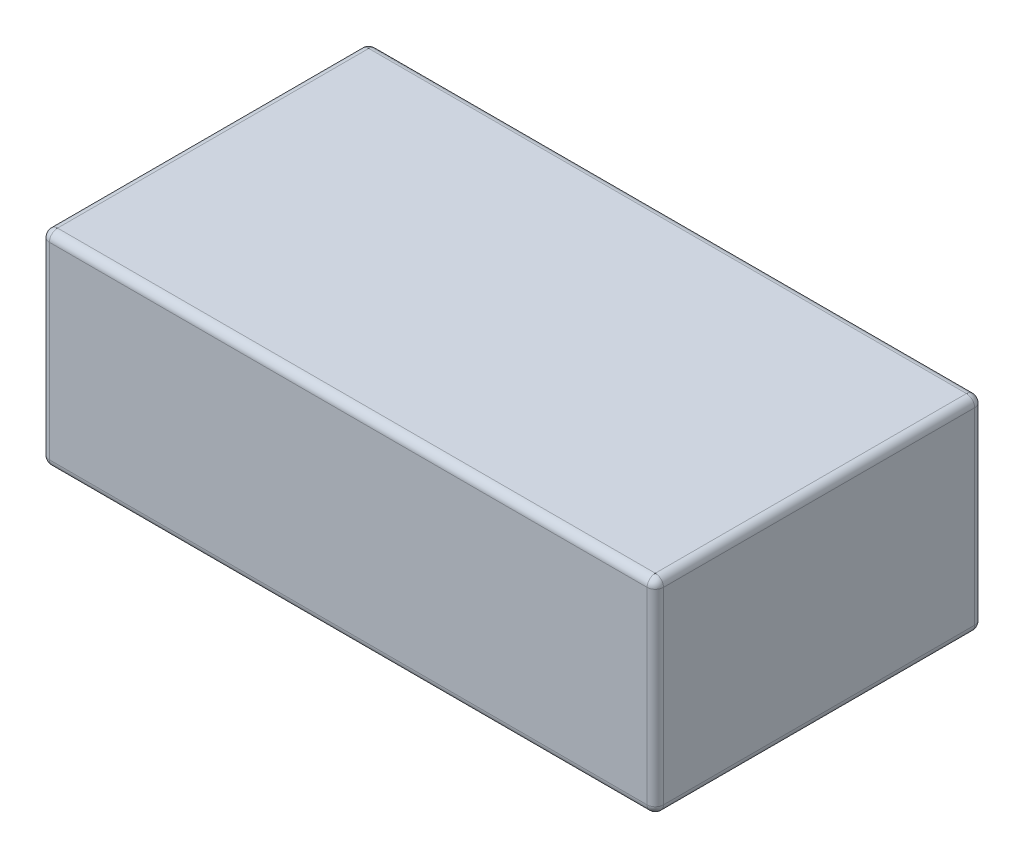
ISO-10303-21;
HEADER;
FILE_DESCRIPTION(('STEP AP214'),'2;1');
FILE_NAME('part.step','',(''),(''),'','','');
FILE_SCHEMA(('AUTOMOTIVE_DESIGN { 1 0 10303 214 1 1 1 1 }'));
ENDSEC;
DATA;
#1=APPLICATION_CONTEXT('core data for automotive mechanical design processes');
#2=APPLICATION_PROTOCOL_DEFINITION('international standard','automotive_design',2000,#1);
#3=PRODUCT_CONTEXT('',#1,'mechanical');
#4=PRODUCT('Part','Part','',(#3));
#5=PRODUCT_RELATED_PRODUCT_CATEGORY('part','',(#4));
#6=PRODUCT_DEFINITION_FORMATION('','',#4);
#7=PRODUCT_DEFINITION_CONTEXT('part definition',#1,'design');
#8=PRODUCT_DEFINITION('design','',#6,#7);
#9=PRODUCT_DEFINITION_SHAPE('','',#8);
#10=(LENGTH_UNIT() NAMED_UNIT(*) SI_UNIT(.MILLI.,.METRE.));
#11=(NAMED_UNIT(*) PLANE_ANGLE_UNIT() SI_UNIT($,.RADIAN.));
#12=(NAMED_UNIT(*) SI_UNIT($,.STERADIAN.) SOLID_ANGLE_UNIT());
#13=UNCERTAINTY_MEASURE_WITH_UNIT(LENGTH_MEASURE(1.E-05),#10,'distance_accuracy_value','');
#14=(GEOMETRIC_REPRESENTATION_CONTEXT(3) GLOBAL_UNCERTAINTY_ASSIGNED_CONTEXT((#13)) GLOBAL_UNIT_ASSIGNED_CONTEXT((#10,
#11,#12)) REPRESENTATION_CONTEXT('',''));
#15=CARTESIAN_POINT('',(0.,0.,0.));
#16=DIRECTION('',(0.,0.,1.));
#17=DIRECTION('',(1.,0.,0.));
#18=AXIS2_PLACEMENT_3D('',#15,#16,#17);
#19=CARTESIAN_POINT('',(-0.73,0.25,0.38));
#20=DIRECTION('',(0.,-1.,0.));
#21=DIRECTION('',(0.,0.,-1.));
#22=AXIS2_PLACEMENT_3D('',#19,#20,#21);
#23=CYLINDRICAL_SURFACE('',#22,0.02);
#24=DIRECTION('',(0.,-1.,0.));
#25=VECTOR('',#24,1.);
#26=CARTESIAN_POINT('',(-0.73,0.25,0.4));
#27=LINE('',#26,#25);
#28=CARTESIAN_POINT('',(-0.73,0.23,0.4));
#29=VERTEX_POINT('',#28);
#30=CARTESIAN_POINT('',(-0.73,-0.23,0.4));
#31=VERTEX_POINT('',#30);
#32=EDGE_CURVE('E152',#29,#31,#27,.T.);
#33=ORIENTED_EDGE('',*,*,#32,.F.);
#34=CARTESIAN_POINT('',(-0.73,0.23,0.38));
#35=DIRECTION('',(0.,-1.,0.));
#36=DIRECTION('',(0.,0.,-1.));
#37=AXIS2_PLACEMENT_3D('',#34,#35,#36);
#38=CIRCLE('',#37,0.02);
#39=CARTESIAN_POINT('',(-0.75,0.23,0.38));
#40=VERTEX_POINT('',#39);
#41=EDGE_CURVE('E139',#29,#40,#38,.T.);
#42=ORIENTED_EDGE('',*,*,#41,.T.);
#43=DIRECTION('',(0.,-1.,0.));
#44=VECTOR('',#43,1.);
#45=CARTESIAN_POINT('',(-0.75,0.25,0.38));
#46=LINE('',#45,#44);
#47=CARTESIAN_POINT('',(-0.75,-0.23,0.38));
#48=VERTEX_POINT('',#47);
#49=EDGE_CURVE('E210',#40,#48,#46,.T.);
#50=ORIENTED_EDGE('',*,*,#49,.T.);
#51=CARTESIAN_POINT('',(-0.73,-0.23,0.38));
#52=DIRECTION('',(0.,-1.,0.));
#53=DIRECTION('',(0.,0.,-1.));
#54=AXIS2_PLACEMENT_3D('',#51,#52,#53);
#55=CIRCLE('',#54,0.02);
#56=EDGE_CURVE('E190',#48,#31,#55,.F.);
#57=ORIENTED_EDGE('',*,*,#56,.T.);
#58=EDGE_LOOP('',(#33,#42,#50,#57));
#59=FACE_BOUND('',#58,.T.);
#60=ADVANCED_FACE('F34',(#59),#23,.T.);
#61=CARTESIAN_POINT('',(-0.73,0.25,0.4));
#62=DIRECTION('',(0.,0.,-1.));
#63=DIRECTION('',(-1.,0.,0.));
#64=AXIS2_PLACEMENT_3D('',#61,#62,#63);
#65=PLANE('',#64);
#66=DIRECTION('',(0.,-1.,0.));
#67=VECTOR('',#66,1.);
#68=CARTESIAN_POINT('',(0.73,0.25,0.4));
#69=LINE('',#68,#67);
#70=CARTESIAN_POINT('',(0.73,0.23,0.4));
#71=VERTEX_POINT('',#70);
#72=CARTESIAN_POINT('',(0.73,-0.23,0.4));
#73=VERTEX_POINT('',#72);
#74=EDGE_CURVE('E270',#71,#73,#69,.T.);
#75=ORIENTED_EDGE('',*,*,#74,.F.);
#76=DIRECTION('',(1.,0.,0.));
#77=VECTOR('',#76,1.);
#78=CARTESIAN_POINT('',(-0.73,0.23,0.4));
#79=LINE('',#78,#77);
#80=EDGE_CURVE('E188',#71,#29,#79,.F.);
#81=ORIENTED_EDGE('',*,*,#80,.T.);
#82=ORIENTED_EDGE('',*,*,#32,.T.);
#83=DIRECTION('',(1.,0.,0.));
#84=VECTOR('',#83,1.);
#85=CARTESIAN_POINT('',(-0.73,-0.23,0.4));
#86=LINE('',#85,#84);
#87=EDGE_CURVE('E185',#31,#73,#86,.T.);
#88=ORIENTED_EDGE('',*,*,#87,.T.);
#89=EDGE_LOOP('',(#75,#81,#82,#88));
#90=FACE_BOUND('',#89,.T.);
#91=ADVANCED_FACE('F312',(#90),#65,.F.);
#92=CARTESIAN_POINT('',(0.73,0.25,0.38));
#93=DIRECTION('',(0.,-1.,0.));
#94=DIRECTION('',(0.,0.,-1.));
#95=AXIS2_PLACEMENT_3D('',#92,#93,#94);
#96=CYLINDRICAL_SURFACE('',#95,0.0200000000000001);
#97=DIRECTION('',(0.,-1.,0.));
#98=VECTOR('',#97,1.);
#99=CARTESIAN_POINT('',(0.75,0.25,0.38));
#100=LINE('',#99,#98);
#101=CARTESIAN_POINT('',(0.75,0.23,0.38));
#102=VERTEX_POINT('',#101);
#103=CARTESIAN_POINT('',(0.75,-0.23,0.38));
#104=VERTEX_POINT('',#103);
#105=EDGE_CURVE('E267',#102,#104,#100,.T.);
#106=ORIENTED_EDGE('',*,*,#105,.F.);
#107=CARTESIAN_POINT('',(0.73,0.23,0.38));
#108=DIRECTION('',(0.,-1.,0.));
#109=DIRECTION('',(0.,0.,-1.));
#110=AXIS2_PLACEMENT_3D('',#107,#108,#109);
#111=CIRCLE('',#110,0.0200000000000001);
#112=EDGE_CURVE('E183',#102,#71,#111,.T.);
#113=ORIENTED_EDGE('',*,*,#112,.T.);
#114=ORIENTED_EDGE('',*,*,#74,.T.);
#115=CARTESIAN_POINT('',(0.73,-0.23,0.38));
#116=DIRECTION('',(0.,-1.,0.));
#117=DIRECTION('',(0.,0.,-1.));
#118=AXIS2_PLACEMENT_3D('',#115,#116,#117);
#119=CIRCLE('',#118,0.0200000000000001);
#120=EDGE_CURVE('E181',#73,#104,#119,.F.);
#121=ORIENTED_EDGE('',*,*,#120,.T.);
#122=EDGE_LOOP('',(#106,#113,#114,#121));
#123=FACE_BOUND('',#122,.T.);
#124=ADVANCED_FACE('F313',(#123),#96,.T.);
#125=CARTESIAN_POINT('',(0.75,0.25,0.38));
#126=DIRECTION('',(-1.,0.,0.));
#127=DIRECTION('',(0.,0.,1.));
#128=AXIS2_PLACEMENT_3D('',#125,#126,#127);
#129=PLANE('',#128);
#130=DIRECTION('',(0.,-1.,0.));
#131=VECTOR('',#130,1.);
#132=CARTESIAN_POINT('',(0.75,0.25,-0.38));
#133=LINE('',#132,#131);
#134=CARTESIAN_POINT('',(0.75,0.23,-0.38));
#135=VERTEX_POINT('',#134);
#136=CARTESIAN_POINT('',(0.75,-0.23,-0.38));
#137=VERTEX_POINT('',#136);
#138=EDGE_CURVE('E264',#135,#137,#133,.T.);
#139=ORIENTED_EDGE('',*,*,#138,.F.);
#140=DIRECTION('',(0.,0.,-1.));
#141=VECTOR('',#140,1.);
#142=CARTESIAN_POINT('',(0.75,0.23,0.38));
#143=LINE('',#142,#141);
#144=EDGE_CURVE('E179',#135,#102,#143,.F.);
#145=ORIENTED_EDGE('',*,*,#144,.T.);
#146=ORIENTED_EDGE('',*,*,#105,.T.);
#147=DIRECTION('',(0.,0.,-1.));
#148=VECTOR('',#147,1.);
#149=CARTESIAN_POINT('',(0.75,-0.23,0.38));
#150=LINE('',#149,#148);
#151=EDGE_CURVE('E177',#104,#137,#150,.T.);
#152=ORIENTED_EDGE('',*,*,#151,.T.);
#153=EDGE_LOOP('',(#139,#145,#146,#152));
#154=FACE_BOUND('',#153,.T.);
#155=ADVANCED_FACE('F495',(#154),#129,.F.);
#156=CARTESIAN_POINT('',(0.73,0.25,-0.38));
#157=DIRECTION('',(0.,-1.,0.));
#158=DIRECTION('',(0.,0.,-1.));
#159=AXIS2_PLACEMENT_3D('',#156,#157,#158);
#160=CYLINDRICAL_SURFACE('',#159,0.0200000000000001);
#161=DIRECTION('',(0.,-1.,0.));
#162=VECTOR('',#161,1.);
#163=CARTESIAN_POINT('',(0.73,0.25,-0.4));
#164=LINE('',#163,#162);
#165=CARTESIAN_POINT('',(0.73,0.23,-0.4));
#166=VERTEX_POINT('',#165);
#167=CARTESIAN_POINT('',(0.73,-0.23,-0.4));
#168=VERTEX_POINT('',#167);
#169=EDGE_CURVE('E261',#166,#168,#164,.T.);
#170=ORIENTED_EDGE('',*,*,#169,.F.);
#171=CARTESIAN_POINT('',(0.73,0.23,-0.38));
#172=DIRECTION('',(0.,-1.,0.));
#173=DIRECTION('',(0.,0.,-1.));
#174=AXIS2_PLACEMENT_3D('',#171,#172,#173);
#175=CIRCLE('',#174,0.0200000000000001);
#176=EDGE_CURVE('E175',#166,#135,#175,.T.);
#177=ORIENTED_EDGE('',*,*,#176,.T.);
#178=ORIENTED_EDGE('',*,*,#138,.T.);
#179=CARTESIAN_POINT('',(0.73,-0.23,-0.38));
#180=DIRECTION('',(0.,-1.,0.));
#181=DIRECTION('',(0.,0.,-1.));
#182=AXIS2_PLACEMENT_3D('',#179,#180,#181);
#183=CIRCLE('',#182,0.0200000000000001);
#184=EDGE_CURVE('E173',#137,#168,#183,.F.);
#185=ORIENTED_EDGE('',*,*,#184,.T.);
#186=EDGE_LOOP('',(#170,#177,#178,#185));
#187=FACE_BOUND('',#186,.T.);
#188=ADVANCED_FACE('F487',(#187),#160,.T.);
#189=CARTESIAN_POINT('',(-0.73,0.25,-0.4));
#190=DIRECTION('',(0.,0.,1.));
#191=DIRECTION('',(1.,0.,0.));
#192=AXIS2_PLACEMENT_3D('',#189,#190,#191);
#193=PLANE('',#192);
#194=DIRECTION('',(0.,-1.,0.));
#195=VECTOR('',#194,1.);
#196=CARTESIAN_POINT('',(-0.73,0.25,-0.4));
#197=LINE('',#196,#195);
#198=CARTESIAN_POINT('',(-0.73,0.23,-0.4));
#199=VERTEX_POINT('',#198);
#200=CARTESIAN_POINT('',(-0.73,-0.23,-0.4));
#201=VERTEX_POINT('',#200);
#202=EDGE_CURVE('E256',#199,#201,#197,.T.);
#203=ORIENTED_EDGE('',*,*,#202,.F.);
#204=DIRECTION('',(-1.,0.,0.));
#205=VECTOR('',#204,1.);
#206=CARTESIAN_POINT('',(0.73,0.23,-0.4));
#207=LINE('',#206,#205);
#208=EDGE_CURVE('E171',#199,#166,#207,.F.);
#209=ORIENTED_EDGE('',*,*,#208,.T.);
#210=ORIENTED_EDGE('',*,*,#169,.T.);
#211=DIRECTION('',(-1.,0.,0.));
#212=VECTOR('',#211,1.);
#213=CARTESIAN_POINT('',(-0.73,-0.23,-0.4));
#214=LINE('',#213,#212);
#215=EDGE_CURVE('E169',#168,#201,#214,.T.);
#216=ORIENTED_EDGE('',*,*,#215,.T.);
#217=EDGE_LOOP('',(#203,#209,#210,#216));
#218=FACE_BOUND('',#217,.T.);
#219=ADVANCED_FACE('F293',(#218),#193,.F.);
#220=CARTESIAN_POINT('',(-0.73,0.25,-0.38));
#221=DIRECTION('',(0.,-1.,0.));
#222=DIRECTION('',(0.,0.,-1.));
#223=AXIS2_PLACEMENT_3D('',#220,#221,#222);
#224=CYLINDRICAL_SURFACE('',#223,0.02);
#225=DIRECTION('',(0.,-1.,0.));
#226=VECTOR('',#225,1.);
#227=CARTESIAN_POINT('',(-0.75,0.25,-0.38));
#228=LINE('',#227,#226);
#229=CARTESIAN_POINT('',(-0.75,0.23,-0.38));
#230=VERTEX_POINT('',#229);
#231=CARTESIAN_POINT('',(-0.75,-0.23,-0.38));
#232=VERTEX_POINT('',#231);
#233=EDGE_CURVE('E251',#230,#232,#228,.T.);
#234=ORIENTED_EDGE('',*,*,#233,.F.);
#235=CARTESIAN_POINT('',(-0.73,0.23,-0.38));
#236=DIRECTION('',(0.,-1.,0.));
#237=DIRECTION('',(0.,0.,-1.));
#238=AXIS2_PLACEMENT_3D('',#235,#236,#237);
#239=CIRCLE('',#238,0.02);
#240=EDGE_CURVE('E167',#230,#199,#239,.T.);
#241=ORIENTED_EDGE('',*,*,#240,.T.);
#242=ORIENTED_EDGE('',*,*,#202,.T.);
#243=CARTESIAN_POINT('',(-0.73,-0.23,-0.38));
#244=DIRECTION('',(0.,-1.,0.));
#245=DIRECTION('',(0.,0.,-1.));
#246=AXIS2_PLACEMENT_3D('',#243,#244,#245);
#247=CIRCLE('',#246,0.02);
#248=EDGE_CURVE('E165',#201,#232,#247,.F.);
#249=ORIENTED_EDGE('',*,*,#248,.T.);
#250=EDGE_LOOP('',(#234,#241,#242,#249));
#251=FACE_BOUND('',#250,.T.);
#252=ADVANCED_FACE('F291',(#251),#224,.T.);
#253=CARTESIAN_POINT('',(-0.75,0.25,0.38));
#254=DIRECTION('',(1.,0.,0.));
#255=DIRECTION('',(0.,0.,-1.));
#256=AXIS2_PLACEMENT_3D('',#253,#254,#255);
#257=PLANE('',#256);
#258=ORIENTED_EDGE('',*,*,#49,.F.);
#259=DIRECTION('',(0.,0.,1.));
#260=VECTOR('',#259,1.);
#261=CARTESIAN_POINT('',(-0.75,0.23,-0.38));
#262=LINE('',#261,#260);
#263=EDGE_CURVE('E130',#40,#230,#262,.F.);
#264=ORIENTED_EDGE('',*,*,#263,.T.);
#265=ORIENTED_EDGE('',*,*,#233,.T.);
#266=DIRECTION('',(0.,0.,1.));
#267=VECTOR('',#266,1.);
#268=CARTESIAN_POINT('',(-0.75,-0.23,0.38));
#269=LINE('',#268,#267);
#270=EDGE_CURVE('E158',#232,#48,#269,.T.);
#271=ORIENTED_EDGE('',*,*,#270,.T.);
#272=EDGE_LOOP('',(#258,#264,#265,#271));
#273=FACE_BOUND('',#272,.T.);
#274=ADVANCED_FACE('F249',(#273),#257,.F.);
#275=CARTESIAN_POINT('',(-0.73,0.25,0.38));
#276=DIRECTION('',(0.,1.,0.));
#277=DIRECTION('',(0.,0.,1.));
#278=AXIS2_PLACEMENT_3D('',#275,#276,#277);
#279=PLANE('',#278);
#280=DIRECTION('',(-1.,0.,0.));
#281=VECTOR('',#280,1.);
#282=CARTESIAN_POINT('',(-0.73,0.25,-0.38));
#283=LINE('',#282,#281);
#284=CARTESIAN_POINT('',(0.73,0.25,-0.38));
#285=VERTEX_POINT('',#284);
#286=CARTESIAN_POINT('',(-0.73,0.25,-0.38));
#287=VERTEX_POINT('',#286);
#288=EDGE_CURVE('E156',#285,#287,#283,.T.);
#289=ORIENTED_EDGE('',*,*,#288,.T.);
#290=DIRECTION('',(0.,0.,1.));
#291=VECTOR('',#290,1.);
#292=CARTESIAN_POINT('',(-0.73,0.25,0.38));
#293=LINE('',#292,#291);
#294=CARTESIAN_POINT('',(-0.73,0.25,0.38));
#295=VERTEX_POINT('',#294);
#296=EDGE_CURVE('E128',#287,#295,#293,.T.);
#297=ORIENTED_EDGE('',*,*,#296,.T.);
#298=DIRECTION('',(1.,0.,0.));
#299=VECTOR('',#298,1.);
#300=CARTESIAN_POINT('',(0.73,0.25,0.38));
#301=LINE('',#300,#299);
#302=CARTESIAN_POINT('',(0.73,0.25,0.38));
#303=VERTEX_POINT('',#302);
#304=EDGE_CURVE('E145',#295,#303,#301,.T.);
#305=ORIENTED_EDGE('',*,*,#304,.T.);
#306=DIRECTION('',(0.,0.,-1.));
#307=VECTOR('',#306,1.);
#308=CARTESIAN_POINT('',(0.73,0.25,-0.38));
#309=LINE('',#308,#307);
#310=EDGE_CURVE('E151',#303,#285,#309,.T.);
#311=ORIENTED_EDGE('',*,*,#310,.T.);
#312=EDGE_LOOP('',(#289,#297,#305,#311));
#313=FACE_BOUND('',#312,.T.);
#314=ADVANCED_FACE('F154',(#313),#279,.T.);
#315=CARTESIAN_POINT('',(-0.73,-0.25,0.38));
#316=DIRECTION('',(0.,1.,0.));
#317=DIRECTION('',(0.,0.,1.));
#318=AXIS2_PLACEMENT_3D('',#315,#316,#317);
#319=PLANE('',#318);
#320=DIRECTION('',(0.,0.,-1.));
#321=VECTOR('',#320,1.);
#322=CARTESIAN_POINT('',(0.73,-0.25,0.38));
#323=LINE('',#322,#321);
#324=CARTESIAN_POINT('',(0.73,-0.25,-0.38));
#325=VERTEX_POINT('',#324);
#326=CARTESIAN_POINT('',(0.73,-0.25,0.38));
#327=VERTEX_POINT('',#326);
#328=EDGE_CURVE('E43',#325,#327,#323,.F.);
#329=ORIENTED_EDGE('',*,*,#328,.T.);
#330=DIRECTION('',(1.,0.,0.));
#331=VECTOR('',#330,1.);
#332=CARTESIAN_POINT('',(-0.73,-0.25,0.38));
#333=LINE('',#332,#331);
#334=CARTESIAN_POINT('',(-0.73,-0.25,0.38));
#335=VERTEX_POINT('',#334);
#336=EDGE_CURVE('E11',#327,#335,#333,.F.);
#337=ORIENTED_EDGE('',*,*,#336,.T.);
#338=DIRECTION('',(0.,0.,1.));
#339=VECTOR('',#338,1.);
#340=CARTESIAN_POINT('',(-0.73,-0.25,0.38));
#341=LINE('',#340,#339);
#342=CARTESIAN_POINT('',(-0.73,-0.25,-0.38));
#343=VERTEX_POINT('',#342);
#344=EDGE_CURVE('E193',#335,#343,#341,.F.);
#345=ORIENTED_EDGE('',*,*,#344,.T.);
#346=DIRECTION('',(-1.,0.,0.));
#347=VECTOR('',#346,1.);
#348=CARTESIAN_POINT('',(-0.73,-0.25,-0.38));
#349=LINE('',#348,#347);
#350=EDGE_CURVE('E54',#343,#325,#349,.F.);
#351=ORIENTED_EDGE('',*,*,#350,.T.);
#352=EDGE_LOOP('',(#329,#337,#345,#351));
#353=FACE_BOUND('',#352,.T.);
#354=ADVANCED_FACE('F449',(#353),#319,.F.);
#355=CARTESIAN_POINT('',(0.73,0.23,0.38));
#356=DIRECTION('',(0.,0.,1.));
#357=DIRECTION('',(1.,0.,0.));
#358=AXIS2_PLACEMENT_3D('',#355,#356,#357);
#359=CYLINDRICAL_SURFACE('',#358,0.02);
#360=CARTESIAN_POINT('',(0.73,0.23,0.38));
#361=DIRECTION('',(0.,0.,1.));
#362=DIRECTION('',(1.,0.,0.));
#363=AXIS2_PLACEMENT_3D('',#360,#361,#362);
#364=CIRCLE('',#363,0.02);
#365=EDGE_CURVE('E204',#102,#303,#364,.T.);
#366=ORIENTED_EDGE('',*,*,#365,.F.);
#367=ORIENTED_EDGE('',*,*,#144,.F.);
#368=CARTESIAN_POINT('',(0.73,0.23,-0.38));
#369=DIRECTION('',(0.,0.,-1.));
#370=DIRECTION('',(-1.,0.,0.));
#371=AXIS2_PLACEMENT_3D('',#368,#369,#370);
#372=CIRCLE('',#371,0.02);
#373=EDGE_CURVE('E207',#285,#135,#372,.T.);
#374=ORIENTED_EDGE('',*,*,#373,.F.);
#375=ORIENTED_EDGE('',*,*,#310,.F.);
#376=EDGE_LOOP('',(#366,#367,#374,#375));
#377=FACE_BOUND('',#376,.T.);
#378=ADVANCED_FACE('F278',(#377),#359,.T.);
#379=CARTESIAN_POINT('',(0.73,0.23,-0.38));
#380=DIRECTION('',(0.,1.,0.));
#381=DIRECTION('',(0.,0.,1.));
#382=AXIS2_PLACEMENT_3D('',#379,#380,#381);
#383=SPHERICAL_SURFACE('',#382,0.02);
#384=ORIENTED_EDGE('',*,*,#373,.T.);
#385=ORIENTED_EDGE('',*,*,#176,.F.);
#386=CARTESIAN_POINT('',(0.73,0.23,-0.38));
#387=DIRECTION('',(-1.,0.,0.));
#388=DIRECTION('',(0.,0.,1.));
#389=AXIS2_PLACEMENT_3D('',#386,#387,#388);
#390=CIRCLE('',#389,0.02);
#391=EDGE_CURVE('E201',#285,#166,#390,.T.);
#392=ORIENTED_EDGE('',*,*,#391,.F.);
#393=EDGE_LOOP('',(#384,#385,#392));
#394=FACE_BOUND('',#393,.T.);
#395=ADVANCED_FACE('F281',(#394),#383,.T.);
#396=CARTESIAN_POINT('',(0.73,0.23,0.38));
#397=DIRECTION('',(0.,1.,0.));
#398=DIRECTION('',(0.,0.,1.));
#399=AXIS2_PLACEMENT_3D('',#396,#397,#398);
#400=SPHERICAL_SURFACE('',#399,0.02);
#401=ORIENTED_EDGE('',*,*,#112,.F.);
#402=ORIENTED_EDGE('',*,*,#365,.T.);
#403=CARTESIAN_POINT('',(0.73,0.23,0.38));
#404=DIRECTION('',(-1.,0.,0.));
#405=DIRECTION('',(0.,0.,1.));
#406=AXIS2_PLACEMENT_3D('',#403,#404,#405);
#407=CIRCLE('',#406,0.02);
#408=EDGE_CURVE('E148',#71,#303,#407,.T.);
#409=ORIENTED_EDGE('',*,*,#408,.F.);
#410=EDGE_LOOP('',(#401,#402,#409));
#411=FACE_BOUND('',#410,.T.);
#412=ADVANCED_FACE('F316',(#411),#400,.T.);
#413=CARTESIAN_POINT('',(-0.73,0.23,-0.38));
#414=DIRECTION('',(1.,0.,0.));
#415=DIRECTION('',(0.,0.,-1.));
#416=AXIS2_PLACEMENT_3D('',#413,#414,#415);
#417=CYLINDRICAL_SURFACE('',#416,0.02);
#418=ORIENTED_EDGE('',*,*,#391,.T.);
#419=ORIENTED_EDGE('',*,*,#208,.F.);
#420=CARTESIAN_POINT('',(-0.73,0.23,-0.38));
#421=DIRECTION('',(-1.,0.,0.));
#422=DIRECTION('',(0.,0.,1.));
#423=AXIS2_PLACEMENT_3D('',#420,#421,#422);
#424=CIRCLE('',#423,0.02);
#425=EDGE_CURVE('E142',#287,#199,#424,.T.);
#426=ORIENTED_EDGE('',*,*,#425,.F.);
#427=ORIENTED_EDGE('',*,*,#288,.F.);
#428=EDGE_LOOP('',(#418,#419,#426,#427));
#429=FACE_BOUND('',#428,.T.);
#430=ADVANCED_FACE('F284',(#429),#417,.T.);
#431=CARTESIAN_POINT('',(-0.73,0.23,0.38));
#432=DIRECTION('',(-1.,0.,0.));
#433=DIRECTION('',(0.,0.,1.));
#434=AXIS2_PLACEMENT_3D('',#431,#432,#433);
#435=CYLINDRICAL_SURFACE('',#434,0.02);
#436=ORIENTED_EDGE('',*,*,#408,.T.);
#437=ORIENTED_EDGE('',*,*,#304,.F.);
#438=CARTESIAN_POINT('',(-0.73,0.23,0.38));
#439=DIRECTION('',(-1.,0.,0.));
#440=DIRECTION('',(0.,0.,1.));
#441=AXIS2_PLACEMENT_3D('',#438,#439,#440);
#442=CIRCLE('',#441,0.02);
#443=EDGE_CURVE('E136',#29,#295,#442,.T.);
#444=ORIENTED_EDGE('',*,*,#443,.F.);
#445=ORIENTED_EDGE('',*,*,#80,.F.);
#446=EDGE_LOOP('',(#436,#437,#444,#445));
#447=FACE_BOUND('',#446,.T.);
#448=ADVANCED_FACE('F146',(#447),#435,.T.);
#449=CARTESIAN_POINT('',(-0.73,0.23,-0.38));
#450=DIRECTION('',(0.,1.,0.));
#451=DIRECTION('',(0.,0.,1.));
#452=AXIS2_PLACEMENT_3D('',#449,#450,#451);
#453=SPHERICAL_SURFACE('',#452,0.02);
#454=ORIENTED_EDGE('',*,*,#425,.T.);
#455=ORIENTED_EDGE('',*,*,#240,.F.);
#456=CARTESIAN_POINT('',(-0.73,0.23,-0.38));
#457=DIRECTION('',(0.,0.,1.));
#458=DIRECTION('',(1.,0.,0.));
#459=AXIS2_PLACEMENT_3D('',#456,#457,#458);
#460=CIRCLE('',#459,0.02);
#461=EDGE_CURVE('E133',#287,#230,#460,.T.);
#462=ORIENTED_EDGE('',*,*,#461,.F.);
#463=EDGE_LOOP('',(#454,#455,#462));
#464=FACE_BOUND('',#463,.T.);
#465=ADVANCED_FACE('F288',(#464),#453,.T.);
#466=CARTESIAN_POINT('',(-0.73,0.23,0.38));
#467=DIRECTION('',(0.,1.,0.));
#468=DIRECTION('',(0.,0.,1.));
#469=AXIS2_PLACEMENT_3D('',#466,#467,#468);
#470=SPHERICAL_SURFACE('',#469,0.02);
#471=ORIENTED_EDGE('',*,*,#41,.F.);
#472=ORIENTED_EDGE('',*,*,#443,.T.);
#473=CARTESIAN_POINT('',(-0.73,0.23,0.38));
#474=DIRECTION('',(0.,0.,-1.));
#475=DIRECTION('',(-1.,0.,0.));
#476=AXIS2_PLACEMENT_3D('',#473,#474,#475);
#477=CIRCLE('',#476,0.02);
#478=EDGE_CURVE('E124',#40,#295,#477,.T.);
#479=ORIENTED_EDGE('',*,*,#478,.F.);
#480=EDGE_LOOP('',(#471,#472,#479));
#481=FACE_BOUND('',#480,.T.);
#482=ADVANCED_FACE('F138',(#481),#470,.T.);
#483=CARTESIAN_POINT('',(-0.73,0.23,0.38));
#484=DIRECTION('',(0.,0.,-1.));
#485=DIRECTION('',(-1.,0.,0.));
#486=AXIS2_PLACEMENT_3D('',#483,#484,#485);
#487=CYLINDRICAL_SURFACE('',#486,0.02);
#488=ORIENTED_EDGE('',*,*,#461,.T.);
#489=ORIENTED_EDGE('',*,*,#263,.F.);
#490=ORIENTED_EDGE('',*,*,#478,.T.);
#491=ORIENTED_EDGE('',*,*,#296,.F.);
#492=EDGE_LOOP('',(#488,#489,#490,#491));
#493=FACE_BOUND('',#492,.T.);
#494=ADVANCED_FACE('F126',(#493),#487,.T.);
#495=CARTESIAN_POINT('',(-0.73,-0.23,-0.38));
#496=DIRECTION('',(-1.,0.,0.));
#497=DIRECTION('',(0.,0.,1.));
#498=AXIS2_PLACEMENT_3D('',#495,#496,#497);
#499=CYLINDRICAL_SURFACE('',#498,0.02);
#500=CARTESIAN_POINT('',(-0.73,-0.23,-0.38));
#501=DIRECTION('',(-1.,0.,0.));
#502=DIRECTION('',(0.,0.,1.));
#503=AXIS2_PLACEMENT_3D('',#500,#501,#502);
#504=CIRCLE('',#503,0.02);
#505=EDGE_CURVE('E38',#201,#343,#504,.T.);
#506=ORIENTED_EDGE('',*,*,#505,.F.);
#507=ORIENTED_EDGE('',*,*,#215,.F.);
#508=CARTESIAN_POINT('',(0.73,-0.23,-0.38));
#509=DIRECTION('',(1.,0.,0.));
#510=DIRECTION('',(0.,0.,-1.));
#511=AXIS2_PLACEMENT_3D('',#508,#509,#510);
#512=CIRCLE('',#511,0.02);
#513=EDGE_CURVE('E226',#325,#168,#512,.T.);
#514=ORIENTED_EDGE('',*,*,#513,.F.);
#515=ORIENTED_EDGE('',*,*,#350,.F.);
#516=EDGE_LOOP('',(#506,#507,#514,#515));
#517=FACE_BOUND('',#516,.T.);
#518=ADVANCED_FACE('F36',(#517),#499,.T.);
#519=CARTESIAN_POINT('',(-0.73,-0.23,-0.38));
#520=DIRECTION('',(0.,1.,0.));
#521=DIRECTION('',(0.,0.,1.));
#522=AXIS2_PLACEMENT_3D('',#519,#520,#521);
#523=SPHERICAL_SURFACE('',#522,0.02);
#524=ORIENTED_EDGE('',*,*,#248,.F.);
#525=ORIENTED_EDGE('',*,*,#505,.T.);
#526=CARTESIAN_POINT('',(-0.73,-0.23,-0.38));
#527=DIRECTION('',(0.,0.,1.));
#528=DIRECTION('',(1.,0.,0.));
#529=AXIS2_PLACEMENT_3D('',#526,#527,#528);
#530=CIRCLE('',#529,0.02);
#531=EDGE_CURVE('E224',#232,#343,#530,.T.);
#532=ORIENTED_EDGE('',*,*,#531,.F.);
#533=EDGE_LOOP('',(#524,#525,#532));
#534=FACE_BOUND('',#533,.T.);
#535=ADVANCED_FACE('F236',(#534),#523,.T.);
#536=CARTESIAN_POINT('',(0.73,-0.23,-0.38));
#537=DIRECTION('',(0.,1.,0.));
#538=DIRECTION('',(0.,0.,1.));
#539=AXIS2_PLACEMENT_3D('',#536,#537,#538);
#540=SPHERICAL_SURFACE('',#539,0.02);
#541=ORIENTED_EDGE('',*,*,#513,.T.);
#542=ORIENTED_EDGE('',*,*,#184,.F.);
#543=CARTESIAN_POINT('',(0.73,-0.23,-0.38));
#544=DIRECTION('',(0.,0.,1.));
#545=DIRECTION('',(1.,0.,0.));
#546=AXIS2_PLACEMENT_3D('',#543,#544,#545);
#547=CIRCLE('',#546,0.02);
#548=EDGE_CURVE('E221',#325,#137,#547,.T.);
#549=ORIENTED_EDGE('',*,*,#548,.F.);
#550=EDGE_LOOP('',(#541,#542,#549));
#551=FACE_BOUND('',#550,.T.);
#552=ADVANCED_FACE('F295',(#551),#540,.T.);
#553=CARTESIAN_POINT('',(-0.73,-0.23,0.38));
#554=DIRECTION('',(0.,0.,1.));
#555=DIRECTION('',(1.,0.,0.));
#556=AXIS2_PLACEMENT_3D('',#553,#554,#555);
#557=CYLINDRICAL_SURFACE('',#556,0.02);
#558=ORIENTED_EDGE('',*,*,#531,.T.);
#559=ORIENTED_EDGE('',*,*,#344,.F.);
#560=CARTESIAN_POINT('',(-0.73,-0.23,0.38));
#561=DIRECTION('',(0.,0.,1.));
#562=DIRECTION('',(1.,0.,0.));
#563=AXIS2_PLACEMENT_3D('',#560,#561,#562);
#564=CIRCLE('',#563,0.02);
#565=EDGE_CURVE('E218',#48,#335,#564,.T.);
#566=ORIENTED_EDGE('',*,*,#565,.F.);
#567=ORIENTED_EDGE('',*,*,#270,.F.);
#568=EDGE_LOOP('',(#558,#559,#566,#567));
#569=FACE_BOUND('',#568,.T.);
#570=ADVANCED_FACE('F242',(#569),#557,.T.);
#571=CARTESIAN_POINT('',(0.73,-0.23,0.38));
#572=DIRECTION('',(0.,0.,-1.));
#573=DIRECTION('',(-1.,0.,0.));
#574=AXIS2_PLACEMENT_3D('',#571,#572,#573);
#575=CYLINDRICAL_SURFACE('',#574,0.02);
#576=ORIENTED_EDGE('',*,*,#548,.T.);
#577=ORIENTED_EDGE('',*,*,#151,.F.);
#578=CARTESIAN_POINT('',(0.73,-0.23,0.38));
#579=DIRECTION('',(0.,0.,1.));
#580=DIRECTION('',(1.,0.,0.));
#581=AXIS2_PLACEMENT_3D('',#578,#579,#580);
#582=CIRCLE('',#581,0.02);
#583=EDGE_CURVE('E215',#327,#104,#582,.T.);
#584=ORIENTED_EDGE('',*,*,#583,.F.);
#585=ORIENTED_EDGE('',*,*,#328,.F.);
#586=EDGE_LOOP('',(#576,#577,#584,#585));
#587=FACE_BOUND('',#586,.T.);
#588=ADVANCED_FACE('F298',(#587),#575,.T.);
#589=CARTESIAN_POINT('',(-0.73,-0.23,0.38));
#590=DIRECTION('',(0.,1.,0.));
#591=DIRECTION('',(0.,0.,1.));
#592=AXIS2_PLACEMENT_3D('',#589,#590,#591);
#593=SPHERICAL_SURFACE('',#592,0.02);
#594=ORIENTED_EDGE('',*,*,#56,.F.);
#595=ORIENTED_EDGE('',*,*,#565,.T.);
#596=CARTESIAN_POINT('',(-0.73,-0.23,0.38));
#597=DIRECTION('',(1.,0.,0.));
#598=DIRECTION('',(0.,0.,-1.));
#599=AXIS2_PLACEMENT_3D('',#596,#597,#598);
#600=CIRCLE('',#599,0.02);
#601=EDGE_CURVE('E213',#31,#335,#600,.T.);
#602=ORIENTED_EDGE('',*,*,#601,.F.);
#603=EDGE_LOOP('',(#594,#595,#602));
#604=FACE_BOUND('',#603,.T.);
#605=ADVANCED_FACE('F384',(#604),#593,.T.);
#606=CARTESIAN_POINT('',(0.73,-0.23,0.38));
#607=DIRECTION('',(0.,1.,0.));
#608=DIRECTION('',(0.,0.,1.));
#609=AXIS2_PLACEMENT_3D('',#606,#607,#608);
#610=SPHERICAL_SURFACE('',#609,0.02);
#611=ORIENTED_EDGE('',*,*,#583,.T.);
#612=ORIENTED_EDGE('',*,*,#120,.F.);
#613=CARTESIAN_POINT('',(0.73,-0.23,0.38));
#614=DIRECTION('',(-1.,0.,0.));
#615=DIRECTION('',(0.,0.,1.));
#616=AXIS2_PLACEMENT_3D('',#613,#614,#615);
#617=CIRCLE('',#616,0.02);
#618=EDGE_CURVE('E211',#327,#73,#617,.T.);
#619=ORIENTED_EDGE('',*,*,#618,.F.);
#620=EDGE_LOOP('',(#611,#612,#619));
#621=FACE_BOUND('',#620,.T.);
#622=ADVANCED_FACE('F307',(#621),#610,.T.);
#623=CARTESIAN_POINT('',(-0.73,-0.23,0.38));
#624=DIRECTION('',(1.,0.,0.));
#625=DIRECTION('',(0.,0.,-1.));
#626=AXIS2_PLACEMENT_3D('',#623,#624,#625);
#627=CYLINDRICAL_SURFACE('',#626,0.02);
#628=ORIENTED_EDGE('',*,*,#601,.T.);
#629=ORIENTED_EDGE('',*,*,#336,.F.);
#630=ORIENTED_EDGE('',*,*,#618,.T.);
#631=ORIENTED_EDGE('',*,*,#87,.F.);
#632=EDGE_LOOP('',(#628,#629,#630,#631));
#633=FACE_BOUND('',#632,.T.);
#634=ADVANCED_FACE('F304',(#633),#627,.T.);
#635=CLOSED_SHELL('',(#60,#91,#124,#155,#188,#219,#252,#274,#314,#354,#378,#395,#412,#430,#448,
#465,#482,#494,#518,#535,#552,#570,#588,#605,#622,#634));
#636=MANIFOLD_SOLID_BREP('B2',#635);
#637=ADVANCED_BREP_SHAPE_REPRESENTATION('',(#18,#636),#14);
#638=SHAPE_DEFINITION_REPRESENTATION(#9,#637);
ENDSEC;
END-ISO-10303-21;
